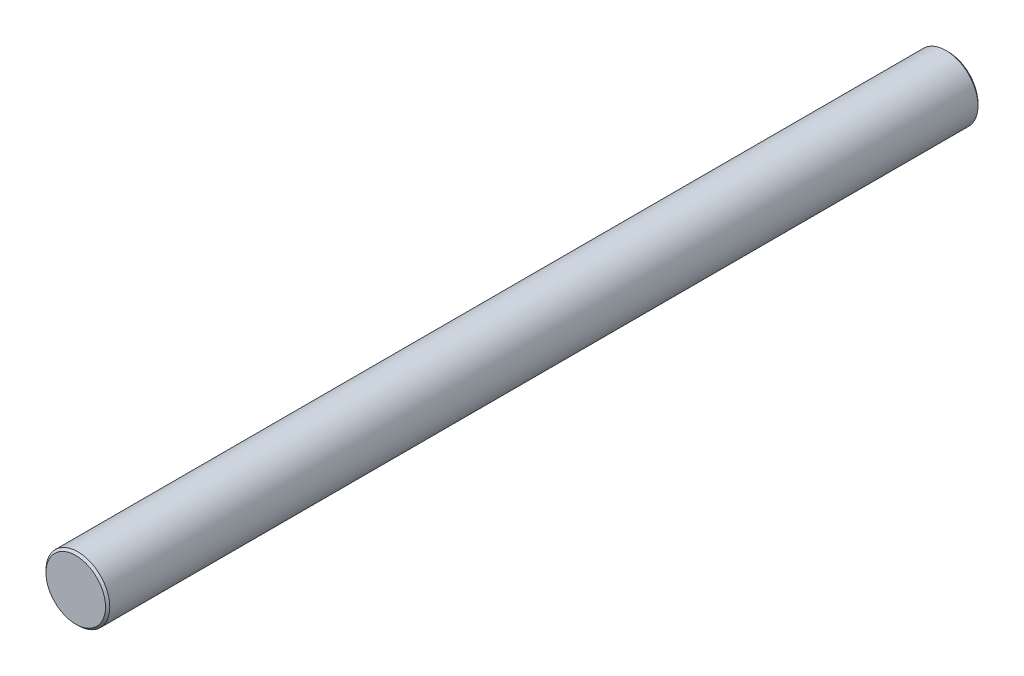
ISO-10303-21;
HEADER;
FILE_DESCRIPTION(('STEP AP214'),'2;1');
FILE_NAME('part.step','',(''),(''),'','','');
FILE_SCHEMA(('AUTOMOTIVE_DESIGN { 1 0 10303 214 1 1 1 1 }'));
ENDSEC;
DATA;
#1=APPLICATION_CONTEXT('core data for automotive mechanical design processes');
#2=APPLICATION_PROTOCOL_DEFINITION('international standard','automotive_design',2000,#1);
#3=PRODUCT_CONTEXT('',#1,'mechanical');
#4=PRODUCT('Part','Part','',(#3));
#5=PRODUCT_RELATED_PRODUCT_CATEGORY('part','',(#4));
#6=PRODUCT_DEFINITION_FORMATION('','',#4);
#7=PRODUCT_DEFINITION_CONTEXT('part definition',#1,'design');
#8=PRODUCT_DEFINITION('design','',#6,#7);
#9=PRODUCT_DEFINITION_SHAPE('','',#8);
#10=(LENGTH_UNIT() NAMED_UNIT(*) SI_UNIT(.MILLI.,.METRE.));
#11=(NAMED_UNIT(*) PLANE_ANGLE_UNIT() SI_UNIT($,.RADIAN.));
#12=(NAMED_UNIT(*) SI_UNIT($,.STERADIAN.) SOLID_ANGLE_UNIT());
#13=UNCERTAINTY_MEASURE_WITH_UNIT(LENGTH_MEASURE(1.E-05),#10,'distance_accuracy_value','');
#14=(GEOMETRIC_REPRESENTATION_CONTEXT(3) GLOBAL_UNCERTAINTY_ASSIGNED_CONTEXT((#13)) GLOBAL_UNIT_ASSIGNED_CONTEXT((#10,
#11,#12)) REPRESENTATION_CONTEXT('',''));
#15=CARTESIAN_POINT('',(0.,0.,0.));
#16=DIRECTION('',(0.,0.,1.));
#17=DIRECTION('',(1.,0.,0.));
#18=AXIS2_PLACEMENT_3D('',#15,#16,#17);
#19=CARTESIAN_POINT('',(0.,0.,82.));
#20=DIRECTION('',(0.,0.,-1.));
#21=DIRECTION('',(-1.,0.,0.));
#22=AXIS2_PLACEMENT_3D('',#19,#20,#21);
#23=CYLINDRICAL_SURFACE('',#22,3.);
#24=CARTESIAN_POINT('',(0.,0.,0.20000000000002));
#25=DIRECTION('',(0.,0.,1.));
#26=DIRECTION('',(1.,0.,0.));
#27=AXIS2_PLACEMENT_3D('',#24,#25,#26);
#28=CIRCLE('',#27,3.);
#29=CARTESIAN_POINT('',(3.,0.,0.20000000000002));
#30=VERTEX_POINT('',#29);
#31=EDGE_CURVE('E51',#30,#30,#28,.T.);
#32=ORIENTED_EDGE('',*,*,#31,.T.);
#33=EDGE_LOOP('',(#32));
#34=FACE_BOUND('',#33,.T.);
#35=CARTESIAN_POINT('',(0.,0.,81.8));
#36=DIRECTION('',(0.,0.,1.));
#37=DIRECTION('',(1.,0.,0.));
#38=AXIS2_PLACEMENT_3D('',#35,#36,#37);
#39=CIRCLE('',#38,3.);
#40=CARTESIAN_POINT('',(3.,0.,81.8));
#41=VERTEX_POINT('',#40);
#42=EDGE_CURVE('E55',#41,#41,#39,.F.);
#43=ORIENTED_EDGE('',*,*,#42,.T.);
#44=EDGE_LOOP('',(#43));
#45=FACE_BOUND('',#44,.T.);
#46=ADVANCED_FACE('F39',(#34,#45),#23,.T.);
#47=CARTESIAN_POINT('',(0.,0.,82.));
#48=DIRECTION('',(0.,0.,1.));
#49=DIRECTION('',(1.,0.,0.));
#50=AXIS2_PLACEMENT_3D('',#47,#48,#49);
#51=PLANE('',#50);
#52=CARTESIAN_POINT('',(0.,0.,82.));
#53=DIRECTION('',(0.,0.,1.));
#54=DIRECTION('',(1.,0.,0.));
#55=AXIS2_PLACEMENT_3D('',#52,#53,#54);
#56=CIRCLE('',#55,2.8);
#57=CARTESIAN_POINT('',(2.8,0.,82.));
#58=VERTEX_POINT('',#57);
#59=EDGE_CURVE('E10',#58,#58,#56,.T.);
#60=ORIENTED_EDGE('',*,*,#59,.T.);
#61=EDGE_LOOP('',(#60));
#62=FACE_BOUND('',#61,.T.);
#63=ADVANCED_FACE('F71',(#62),#51,.T.);
#64=CARTESIAN_POINT('',(0.,0.,0.));
#65=DIRECTION('',(0.,0.,1.));
#66=DIRECTION('',(1.,0.,0.));
#67=AXIS2_PLACEMENT_3D('',#64,#65,#66);
#68=PLANE('',#67);
#69=CARTESIAN_POINT('',(0.,0.,0.));
#70=DIRECTION('',(0.,0.,1.));
#71=DIRECTION('',(1.,0.,0.));
#72=AXIS2_PLACEMENT_3D('',#69,#70,#71);
#73=CIRCLE('',#72,2.79999999999998);
#74=CARTESIAN_POINT('',(2.79999999999998,0.,0.));
#75=VERTEX_POINT('',#74);
#76=EDGE_CURVE('E47',#75,#75,#73,.F.);
#77=ORIENTED_EDGE('',*,*,#76,.T.);
#78=EDGE_LOOP('',(#77));
#79=FACE_BOUND('',#78,.T.);
#80=ADVANCED_FACE('F68',(#79),#68,.F.);
#81=CARTESIAN_POINT('',(0.,0.,0.20000000000002));
#82=DIRECTION('',(0.,0.,1.));
#83=DIRECTION('',(1.,0.,0.));
#84=AXIS2_PLACEMENT_3D('',#81,#82,#83);
#85=CONICAL_SURFACE('',#84,3.,0.785398163397466);
#86=ORIENTED_EDGE('',*,*,#76,.F.);
#87=EDGE_LOOP('',(#86));
#88=FACE_BOUND('',#87,.T.);
#89=ORIENTED_EDGE('',*,*,#31,.F.);
#90=EDGE_LOOP('',(#89));
#91=FACE_BOUND('',#90,.T.);
#92=ADVANCED_FACE('F64',(#88,#91),#85,.T.);
#93=CARTESIAN_POINT('',(0.,0.,82.));
#94=DIRECTION('',(0.,0.,-1.));
#95=DIRECTION('',(-1.,0.,0.));
#96=AXIS2_PLACEMENT_3D('',#93,#94,#95);
#97=CONICAL_SURFACE('',#96,2.8,0.78539816339743);
#98=ORIENTED_EDGE('',*,*,#42,.F.);
#99=EDGE_LOOP('',(#98));
#100=FACE_BOUND('',#99,.T.);
#101=ORIENTED_EDGE('',*,*,#59,.F.);
#102=EDGE_LOOP('',(#101));
#103=FACE_BOUND('',#102,.T.);
#104=ADVANCED_FACE('F42',(#100,#103),#97,.T.);
#105=CLOSED_SHELL('',(#46,#63,#80,#92,#104));
#106=MANIFOLD_SOLID_BREP('B2',#105);
#107=ADVANCED_BREP_SHAPE_REPRESENTATION('',(#18,#106),#14);
#108=SHAPE_DEFINITION_REPRESENTATION(#9,#107);
ENDSEC;
END-ISO-10303-21;
